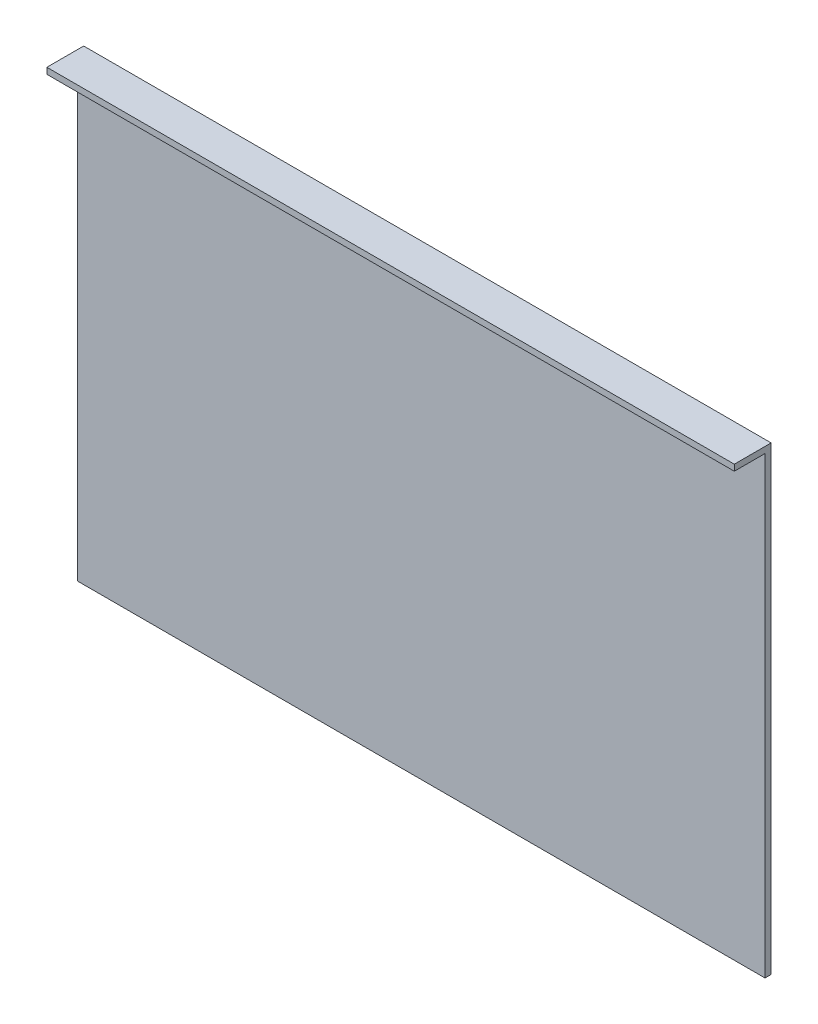
ISO-10303-21;
HEADER;
FILE_DESCRIPTION(('STEP AP214'),'2;1');
FILE_NAME('part.step','',(''),(''),'','','');
FILE_SCHEMA(('AUTOMOTIVE_DESIGN { 1 0 10303 214 1 1 1 1 }'));
ENDSEC;
DATA;
#1=APPLICATION_CONTEXT('core data for automotive mechanical design processes');
#2=APPLICATION_PROTOCOL_DEFINITION('international standard','automotive_design',2000,#1);
#3=PRODUCT_CONTEXT('',#1,'mechanical');
#4=PRODUCT('Part','Part','',(#3));
#5=PRODUCT_RELATED_PRODUCT_CATEGORY('part','',(#4));
#6=PRODUCT_DEFINITION_FORMATION('','',#4);
#7=PRODUCT_DEFINITION_CONTEXT('part definition',#1,'design');
#8=PRODUCT_DEFINITION('design','',#6,#7);
#9=PRODUCT_DEFINITION_SHAPE('','',#8);
#10=(LENGTH_UNIT() NAMED_UNIT(*) SI_UNIT(.MILLI.,.METRE.));
#11=(NAMED_UNIT(*) PLANE_ANGLE_UNIT() SI_UNIT($,.RADIAN.));
#12=(NAMED_UNIT(*) SI_UNIT($,.STERADIAN.) SOLID_ANGLE_UNIT());
#13=UNCERTAINTY_MEASURE_WITH_UNIT(LENGTH_MEASURE(1.E-05),#10,'distance_accuracy_value','');
#14=(GEOMETRIC_REPRESENTATION_CONTEXT(3) GLOBAL_UNCERTAINTY_ASSIGNED_CONTEXT((#13)) GLOBAL_UNIT_ASSIGNED_CONTEXT((#10,
#11,#12)) REPRESENTATION_CONTEXT('',''));
#15=CARTESIAN_POINT('',(0.,0.,0.));
#16=DIRECTION('',(0.,0.,1.));
#17=DIRECTION('',(1.,0.,0.));
#18=AXIS2_PLACEMENT_3D('',#15,#16,#17);
#19=CARTESIAN_POINT('',(0.,0.,0.));
#20=DIRECTION('',(0.,0.,-1.));
#21=DIRECTION('',(-1.,0.,0.));
#22=AXIS2_PLACEMENT_3D('',#19,#20,#21);
#23=PLANE('',#22);
#24=DIRECTION('',(1.,0.,0.));
#25=VECTOR('',#24,1.);
#26=CARTESIAN_POINT('',(0.,296.,0.));
#27=LINE('',#26,#25);
#28=CARTESIAN_POINT('',(0.,296.,0.));
#29=VERTEX_POINT('',#28);
#30=CARTESIAN_POINT('',(448.,296.,0.));
#31=VERTEX_POINT('',#30);
#32=EDGE_CURVE('E55',#29,#31,#27,.T.);
#33=ORIENTED_EDGE('',*,*,#32,.F.);
#34=DIRECTION('',(0.,-1.,0.));
#35=VECTOR('',#34,1.);
#36=CARTESIAN_POINT('',(0.,0.,0.));
#37=LINE('',#36,#35);
#38=CARTESIAN_POINT('',(0.,0.,0.));
#39=VERTEX_POINT('',#38);
#40=EDGE_CURVE('E117',#29,#39,#37,.T.);
#41=ORIENTED_EDGE('',*,*,#40,.T.);
#42=DIRECTION('',(1.,0.,0.));
#43=VECTOR('',#42,1.);
#44=CARTESIAN_POINT('',(0.,0.,0.));
#45=LINE('',#44,#43);
#46=CARTESIAN_POINT('',(448.,0.,0.));
#47=VERTEX_POINT('',#46);
#48=EDGE_CURVE('E119',#39,#47,#45,.T.);
#49=ORIENTED_EDGE('',*,*,#48,.T.);
#50=DIRECTION('',(0.,1.,0.));
#51=VECTOR('',#50,1.);
#52=CARTESIAN_POINT('',(448.,0.,0.));
#53=LINE('',#52,#51);
#54=EDGE_CURVE('E127',#47,#31,#53,.T.);
#55=ORIENTED_EDGE('',*,*,#54,.T.);
#56=EDGE_LOOP('',(#33,#41,#49,#55));
#57=FACE_BOUND('',#56,.T.);
#58=ADVANCED_FACE('F38',(#57),#23,.F.);
#59=CARTESIAN_POINT('',(0.,0.,-4.));
#60=DIRECTION('',(-1.,0.,0.));
#61=DIRECTION('',(0.,0.,1.));
#62=AXIS2_PLACEMENT_3D('',#59,#60,#61);
#63=PLANE('',#62);
#64=ORIENTED_EDGE('',*,*,#40,.F.);
#65=DIRECTION('',(0.,0.,-1.));
#66=VECTOR('',#65,1.);
#67=CARTESIAN_POINT('',(0.,296.,20.));
#68=LINE('',#67,#66);
#69=CARTESIAN_POINT('',(0.,296.,20.));
#70=VERTEX_POINT('',#69);
#71=EDGE_CURVE('E103',#70,#29,#68,.T.);
#72=ORIENTED_EDGE('',*,*,#71,.F.);
#73=DIRECTION('',(0.,-1.,0.));
#74=VECTOR('',#73,1.);
#75=CARTESIAN_POINT('',(0.,300.,20.));
#76=LINE('',#75,#74);
#77=CARTESIAN_POINT('',(0.,300.,20.));
#78=VERTEX_POINT('',#77);
#79=EDGE_CURVE('E110',#78,#70,#76,.T.);
#80=ORIENTED_EDGE('',*,*,#79,.F.);
#81=DIRECTION('',(0.,0.,1.));
#82=VECTOR('',#81,1.);
#83=CARTESIAN_POINT('',(0.,300.,-4.));
#84=LINE('',#83,#82);
#85=CARTESIAN_POINT('',(0.,300.,-4.));
#86=VERTEX_POINT('',#85);
#87=EDGE_CURVE('E11',#86,#78,#84,.T.);
#88=ORIENTED_EDGE('',*,*,#87,.F.);
#89=DIRECTION('',(0.,-1.,0.));
#90=VECTOR('',#89,1.);
#91=CARTESIAN_POINT('',(0.,0.,-4.));
#92=LINE('',#91,#90);
#93=CARTESIAN_POINT('',(0.,0.,-4.));
#94=VERTEX_POINT('',#93);
#95=EDGE_CURVE('E124',#86,#94,#92,.T.);
#96=ORIENTED_EDGE('',*,*,#95,.T.);
#97=DIRECTION('',(0.,0.,1.));
#98=VECTOR('',#97,1.);
#99=CARTESIAN_POINT('',(0.,0.,-4.));
#100=LINE('',#99,#98);
#101=EDGE_CURVE('E42',#94,#39,#100,.T.);
#102=ORIENTED_EDGE('',*,*,#101,.T.);
#103=EDGE_LOOP('',(#64,#72,#80,#88,#96,#102));
#104=FACE_BOUND('',#103,.T.);
#105=ADVANCED_FACE('F40',(#104),#63,.T.);
#106=CARTESIAN_POINT('',(0.,300.,-4.));
#107=DIRECTION('',(0.,1.,0.));
#108=DIRECTION('',(0.,0.,1.));
#109=AXIS2_PLACEMENT_3D('',#106,#107,#108);
#110=PLANE('',#109);
#111=ORIENTED_EDGE('',*,*,#87,.T.);
#112=DIRECTION('',(-1.,0.,0.));
#113=VECTOR('',#112,1.);
#114=CARTESIAN_POINT('',(0.,300.,20.));
#115=LINE('',#114,#113);
#116=CARTESIAN_POINT('',(448.,300.,20.));
#117=VERTEX_POINT('',#116);
#118=EDGE_CURVE('E115',#117,#78,#115,.T.);
#119=ORIENTED_EDGE('',*,*,#118,.F.);
#120=DIRECTION('',(0.,0.,1.));
#121=VECTOR('',#120,1.);
#122=CARTESIAN_POINT('',(448.,300.,-4.));
#123=LINE('',#122,#121);
#124=CARTESIAN_POINT('',(448.,300.,-4.));
#125=VERTEX_POINT('',#124);
#126=EDGE_CURVE('E47',#125,#117,#123,.T.);
#127=ORIENTED_EDGE('',*,*,#126,.F.);
#128=DIRECTION('',(-1.,0.,0.));
#129=VECTOR('',#128,1.);
#130=CARTESIAN_POINT('',(0.,300.,-4.));
#131=LINE('',#130,#129);
#132=EDGE_CURVE('E132',#125,#86,#131,.T.);
#133=ORIENTED_EDGE('',*,*,#132,.T.);
#134=EDGE_LOOP('',(#111,#119,#127,#133));
#135=FACE_BOUND('',#134,.T.);
#136=ADVANCED_FACE('F144',(#135),#110,.T.);
#137=CARTESIAN_POINT('',(448.,0.,-4.));
#138=DIRECTION('',(1.,0.,0.));
#139=DIRECTION('',(0.,0.,-1.));
#140=AXIS2_PLACEMENT_3D('',#137,#138,#139);
#141=PLANE('',#140);
#142=ORIENTED_EDGE('',*,*,#54,.F.);
#143=DIRECTION('',(0.,0.,1.));
#144=VECTOR('',#143,1.);
#145=CARTESIAN_POINT('',(448.,0.,-4.));
#146=LINE('',#145,#144);
#147=CARTESIAN_POINT('',(448.,0.,-4.));
#148=VERTEX_POINT('',#147);
#149=EDGE_CURVE('E78',#148,#47,#146,.T.);
#150=ORIENTED_EDGE('',*,*,#149,.F.);
#151=DIRECTION('',(0.,1.,0.));
#152=VECTOR('',#151,1.);
#153=CARTESIAN_POINT('',(448.,0.,-4.));
#154=LINE('',#153,#152);
#155=EDGE_CURVE('E129',#148,#125,#154,.T.);
#156=ORIENTED_EDGE('',*,*,#155,.T.);
#157=ORIENTED_EDGE('',*,*,#126,.T.);
#158=DIRECTION('',(0.,1.,0.));
#159=VECTOR('',#158,1.);
#160=CARTESIAN_POINT('',(448.,300.,20.));
#161=LINE('',#160,#159);
#162=CARTESIAN_POINT('',(448.,296.,20.));
#163=VERTEX_POINT('',#162);
#164=EDGE_CURVE('E109',#163,#117,#161,.T.);
#165=ORIENTED_EDGE('',*,*,#164,.F.);
#166=DIRECTION('',(0.,0.,-1.));
#167=VECTOR('',#166,1.);
#168=CARTESIAN_POINT('',(448.,296.,20.));
#169=LINE('',#168,#167);
#170=EDGE_CURVE('E105',#163,#31,#169,.T.);
#171=ORIENTED_EDGE('',*,*,#170,.T.);
#172=EDGE_LOOP('',(#142,#150,#156,#157,#165,#171));
#173=FACE_BOUND('',#172,.T.);
#174=ADVANCED_FACE('F140',(#173),#141,.T.);
#175=CARTESIAN_POINT('',(0.,0.,-4.));
#176=DIRECTION('',(0.,-1.,0.));
#177=DIRECTION('',(0.,0.,-1.));
#178=AXIS2_PLACEMENT_3D('',#175,#176,#177);
#179=PLANE('',#178);
#180=ORIENTED_EDGE('',*,*,#48,.F.);
#181=ORIENTED_EDGE('',*,*,#101,.F.);
#182=DIRECTION('',(1.,0.,0.));
#183=VECTOR('',#182,1.);
#184=CARTESIAN_POINT('',(0.,0.,-4.));
#185=LINE('',#184,#183);
#186=EDGE_CURVE('E126',#94,#148,#185,.T.);
#187=ORIENTED_EDGE('',*,*,#186,.T.);
#188=ORIENTED_EDGE('',*,*,#149,.T.);
#189=EDGE_LOOP('',(#180,#181,#187,#188));
#190=FACE_BOUND('',#189,.T.);
#191=ADVANCED_FACE('F138',(#190),#179,.T.);
#192=CARTESIAN_POINT('',(0.,0.,-4.));
#193=DIRECTION('',(0.,0.,-1.));
#194=DIRECTION('',(-1.,0.,0.));
#195=AXIS2_PLACEMENT_3D('',#192,#193,#194);
#196=PLANE('',#195);
#197=ORIENTED_EDGE('',*,*,#95,.F.);
#198=ORIENTED_EDGE('',*,*,#132,.F.);
#199=ORIENTED_EDGE('',*,*,#155,.F.);
#200=ORIENTED_EDGE('',*,*,#186,.F.);
#201=EDGE_LOOP('',(#197,#198,#199,#200));
#202=FACE_BOUND('',#201,.T.);
#203=ADVANCED_FACE('F148',(#202),#196,.T.);
#204=CARTESIAN_POINT('',(0.,296.,20.));
#205=DIRECTION('',(0.,1.,0.));
#206=DIRECTION('',(0.,0.,1.));
#207=AXIS2_PLACEMENT_3D('',#204,#205,#206);
#208=PLANE('',#207);
#209=ORIENTED_EDGE('',*,*,#32,.T.);
#210=ORIENTED_EDGE('',*,*,#170,.F.);
#211=DIRECTION('',(1.,0.,0.));
#212=VECTOR('',#211,1.);
#213=CARTESIAN_POINT('',(0.,296.,20.));
#214=LINE('',#213,#212);
#215=EDGE_CURVE('E99',#70,#163,#214,.T.);
#216=ORIENTED_EDGE('',*,*,#215,.F.);
#217=ORIENTED_EDGE('',*,*,#71,.T.);
#218=EDGE_LOOP('',(#209,#210,#216,#217));
#219=FACE_BOUND('',#218,.T.);
#220=ADVANCED_FACE('F101',(#219),#208,.F.);
#221=CARTESIAN_POINT('',(0.,0.,20.));
#222=DIRECTION('',(0.,0.,1.));
#223=DIRECTION('',(1.,0.,0.));
#224=AXIS2_PLACEMENT_3D('',#221,#222,#223);
#225=PLANE('',#224);
#226=ORIENTED_EDGE('',*,*,#79,.T.);
#227=ORIENTED_EDGE('',*,*,#215,.T.);
#228=ORIENTED_EDGE('',*,*,#164,.T.);
#229=ORIENTED_EDGE('',*,*,#118,.T.);
#230=EDGE_LOOP('',(#226,#227,#228,#229));
#231=FACE_BOUND('',#230,.T.);
#232=ADVANCED_FACE('F113',(#231),#225,.T.);
#233=CLOSED_SHELL('',(#58,#105,#136,#174,#191,#203,#220,#232));
#234=MANIFOLD_SOLID_BREP('B2',#233);
#235=ADVANCED_BREP_SHAPE_REPRESENTATION('',(#18,#234),#14);
#236=SHAPE_DEFINITION_REPRESENTATION(#9,#235);
ENDSEC;
END-ISO-10303-21;
